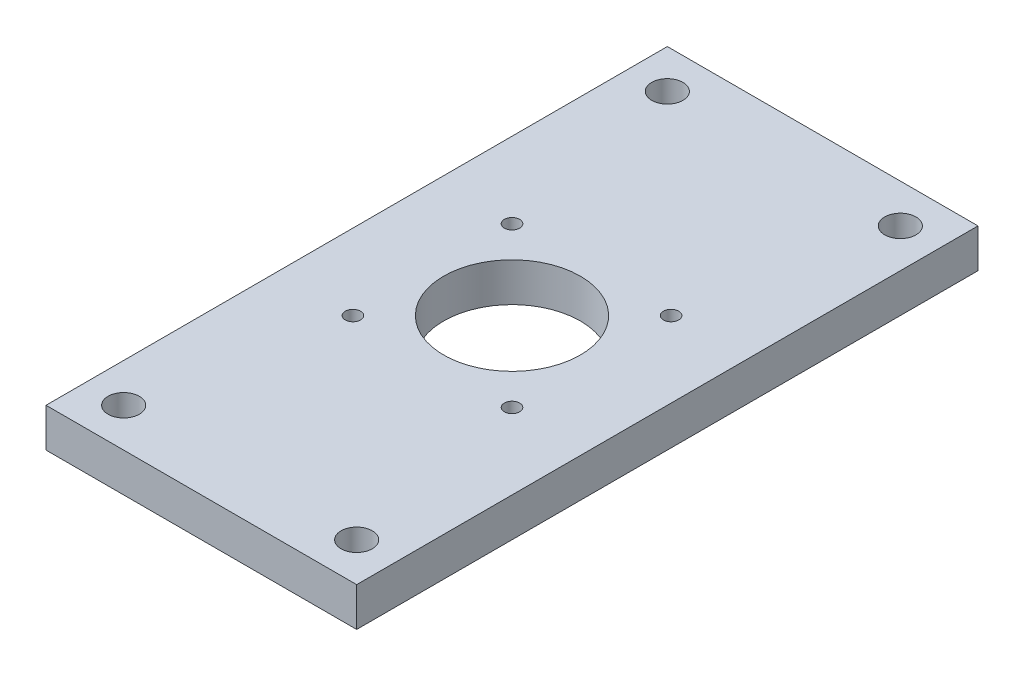
ISO-10303-21;
HEADER;
FILE_DESCRIPTION(('STEP AP214'),'2;1');
FILE_NAME('part.step','',(''),(''),'','','');
FILE_SCHEMA(('AUTOMOTIVE_DESIGN { 1 0 10303 214 1 1 1 1 }'));
ENDSEC;
DATA;
#1=APPLICATION_CONTEXT('core data for automotive mechanical design processes');
#2=APPLICATION_PROTOCOL_DEFINITION('international standard','automotive_design',2000,#1);
#3=PRODUCT_CONTEXT('',#1,'mechanical');
#4=PRODUCT('Part','Part','',(#3));
#5=PRODUCT_RELATED_PRODUCT_CATEGORY('part','',(#4));
#6=PRODUCT_DEFINITION_FORMATION('','',#4);
#7=PRODUCT_DEFINITION_CONTEXT('part definition',#1,'design');
#8=PRODUCT_DEFINITION('design','',#6,#7);
#9=PRODUCT_DEFINITION_SHAPE('','',#8);
#10=(LENGTH_UNIT() NAMED_UNIT(*) SI_UNIT(.MILLI.,.METRE.));
#11=(NAMED_UNIT(*) PLANE_ANGLE_UNIT() SI_UNIT($,.RADIAN.));
#12=(NAMED_UNIT(*) SI_UNIT($,.STERADIAN.) SOLID_ANGLE_UNIT());
#13=UNCERTAINTY_MEASURE_WITH_UNIT(LENGTH_MEASURE(1.E-05),#10,'distance_accuracy_value','');
#14=(GEOMETRIC_REPRESENTATION_CONTEXT(3) GLOBAL_UNCERTAINTY_ASSIGNED_CONTEXT((#13)) GLOBAL_UNIT_ASSIGNED_CONTEXT((#10,
#11,#12)) REPRESENTATION_CONTEXT('',''));
#15=CARTESIAN_POINT('',(0.,0.,0.));
#16=DIRECTION('',(0.,0.,1.));
#17=DIRECTION('',(1.,0.,0.));
#18=AXIS2_PLACEMENT_3D('',#15,#16,#17);
#19=CARTESIAN_POINT('',(-43.46194,-12.7,-50.8));
#20=DIRECTION('',(1.,0.,0.));
#21=DIRECTION('',(0.,0.,-1.));
#22=AXIS2_PLACEMENT_3D('',#19,#20,#21);
#23=PLANE('',#22);
#24=DIRECTION('',(0.,0.,-1.));
#25=VECTOR('',#24,1.);
#26=CARTESIAN_POINT('',(-43.46194,-19.05,-50.8));
#27=LINE('',#26,#25);
#28=CARTESIAN_POINT('',(-43.46194,-19.05,50.8));
#29=VERTEX_POINT('',#28);
#30=CARTESIAN_POINT('',(-43.46194,-19.05,-50.8));
#31=VERTEX_POINT('',#30);
#32=EDGE_CURVE('E99',#29,#31,#27,.T.);
#33=ORIENTED_EDGE('',*,*,#32,.T.);
#34=DIRECTION('',(0.,-1.,0.));
#35=VECTOR('',#34,1.);
#36=CARTESIAN_POINT('',(-43.46194,-12.7,-50.8));
#37=LINE('',#36,#35);
#38=CARTESIAN_POINT('',(-43.46194,-12.7,-50.8));
#39=VERTEX_POINT('',#38);
#40=EDGE_CURVE('E38',#39,#31,#37,.T.);
#41=ORIENTED_EDGE('',*,*,#40,.F.);
#42=DIRECTION('',(0.,0.,-1.));
#43=VECTOR('',#42,1.);
#44=CARTESIAN_POINT('',(-43.46194,-12.7,-50.8));
#45=LINE('',#44,#43);
#46=CARTESIAN_POINT('',(-43.46194,-12.7,50.8));
#47=VERTEX_POINT('',#46);
#48=EDGE_CURVE('E88',#47,#39,#45,.T.);
#49=ORIENTED_EDGE('',*,*,#48,.F.);
#50=DIRECTION('',(0.,-1.,0.));
#51=VECTOR('',#50,1.);
#52=CARTESIAN_POINT('',(-43.46194,-12.7,50.8));
#53=LINE('',#52,#51);
#54=EDGE_CURVE('E11',#47,#29,#53,.T.);
#55=ORIENTED_EDGE('',*,*,#54,.T.);
#56=EDGE_LOOP('',(#33,#41,#49,#55));
#57=FACE_BOUND('',#56,.T.);
#58=ADVANCED_FACE('F35',(#57),#23,.T.);
#59=CARTESIAN_POINT('',(-94.26194,-12.7,50.8));
#60=DIRECTION('',(0.,0.,1.));
#61=DIRECTION('',(1.,0.,0.));
#62=AXIS2_PLACEMENT_3D('',#59,#60,#61);
#63=PLANE('',#62);
#64=DIRECTION('',(1.,0.,0.));
#65=VECTOR('',#64,1.);
#66=CARTESIAN_POINT('',(-94.26194,-19.05,50.8));
#67=LINE('',#66,#65);
#68=CARTESIAN_POINT('',(-94.26194,-19.05,50.8));
#69=VERTEX_POINT('',#68);
#70=EDGE_CURVE('E76',#69,#29,#67,.T.);
#71=ORIENTED_EDGE('',*,*,#70,.T.);
#72=ORIENTED_EDGE('',*,*,#54,.F.);
#73=DIRECTION('',(1.,0.,0.));
#74=VECTOR('',#73,1.);
#75=CARTESIAN_POINT('',(-94.26194,-12.7,50.8));
#76=LINE('',#75,#74);
#77=CARTESIAN_POINT('',(-94.26194,-12.7,50.8));
#78=VERTEX_POINT('',#77);
#79=EDGE_CURVE('E53',#78,#47,#76,.T.);
#80=ORIENTED_EDGE('',*,*,#79,.F.);
#81=DIRECTION('',(0.,-1.,0.));
#82=VECTOR('',#81,1.);
#83=CARTESIAN_POINT('',(-94.26194,-12.7,50.8));
#84=LINE('',#83,#82);
#85=EDGE_CURVE('E44',#78,#69,#84,.T.);
#86=ORIENTED_EDGE('',*,*,#85,.T.);
#87=EDGE_LOOP('',(#71,#72,#80,#86));
#88=FACE_BOUND('',#87,.T.);
#89=ADVANCED_FACE('F106',(#88),#63,.T.);
#90=CARTESIAN_POINT('',(-94.26194,-12.7,-50.8));
#91=DIRECTION('',(-1.,0.,0.));
#92=DIRECTION('',(0.,0.,1.));
#93=AXIS2_PLACEMENT_3D('',#90,#91,#92);
#94=PLANE('',#93);
#95=DIRECTION('',(0.,0.,1.));
#96=VECTOR('',#95,1.);
#97=CARTESIAN_POINT('',(-94.26194,-19.05,-50.8));
#98=LINE('',#97,#96);
#99=CARTESIAN_POINT('',(-94.26194,-19.05,-50.8));
#100=VERTEX_POINT('',#99);
#101=EDGE_CURVE('E70',#100,#69,#98,.T.);
#102=ORIENTED_EDGE('',*,*,#101,.T.);
#103=ORIENTED_EDGE('',*,*,#85,.F.);
#104=DIRECTION('',(0.,0.,1.));
#105=VECTOR('',#104,1.);
#106=CARTESIAN_POINT('',(-94.26194,-12.7,-50.8));
#107=LINE('',#106,#105);
#108=CARTESIAN_POINT('',(-94.26194,-12.7,-50.8));
#109=VERTEX_POINT('',#108);
#110=EDGE_CURVE('E86',#109,#78,#107,.T.);
#111=ORIENTED_EDGE('',*,*,#110,.F.);
#112=DIRECTION('',(0.,-1.,0.));
#113=VECTOR('',#112,1.);
#114=CARTESIAN_POINT('',(-94.26194,-12.7,-50.8));
#115=LINE('',#114,#113);
#116=EDGE_CURVE('E91',#109,#100,#115,.T.);
#117=ORIENTED_EDGE('',*,*,#116,.T.);
#118=EDGE_LOOP('',(#102,#103,#111,#117));
#119=FACE_BOUND('',#118,.T.);
#120=ADVANCED_FACE('F94',(#119),#94,.T.);
#121=CARTESIAN_POINT('',(-94.26194,-12.7,-50.8));
#122=DIRECTION('',(0.,0.,-1.));
#123=DIRECTION('',(-1.,0.,0.));
#124=AXIS2_PLACEMENT_3D('',#121,#122,#123);
#125=PLANE('',#124);
#126=DIRECTION('',(-1.,0.,0.));
#127=VECTOR('',#126,1.);
#128=CARTESIAN_POINT('',(-94.26194,-19.05,-50.8));
#129=LINE('',#128,#127);
#130=EDGE_CURVE('E93',#31,#100,#129,.T.);
#131=ORIENTED_EDGE('',*,*,#130,.T.);
#132=ORIENTED_EDGE('',*,*,#116,.F.);
#133=DIRECTION('',(-1.,0.,0.));
#134=VECTOR('',#133,1.);
#135=CARTESIAN_POINT('',(-94.26194,-12.7,-50.8));
#136=LINE('',#135,#134);
#137=EDGE_CURVE('E83',#39,#109,#136,.T.);
#138=ORIENTED_EDGE('',*,*,#137,.F.);
#139=ORIENTED_EDGE('',*,*,#40,.T.);
#140=EDGE_LOOP('',(#131,#132,#138,#139));
#141=FACE_BOUND('',#140,.T.);
#142=ADVANCED_FACE('F92',(#141),#125,.T.);
#143=CARTESIAN_POINT('',(0.,-12.7,0.));
#144=DIRECTION('',(0.,-1.,0.));
#145=DIRECTION('',(0.,0.,1.));
#146=AXIS2_PLACEMENT_3D('',#143,#144,#145);
#147=PLANE('',#146);
#148=CARTESIAN_POINT('',(-49.81194,-12.7,44.45));
#149=DIRECTION('',(0.,-1.,0.));
#150=DIRECTION('',(0.,0.,-1.));
#151=AXIS2_PLACEMENT_3D('',#148,#149,#150);
#152=CIRCLE('',#151,2.5527);
#153=CARTESIAN_POINT('',(-49.81194,-12.7,47.0027));
#154=VERTEX_POINT('',#153);
#155=EDGE_CURVE('E131',#154,#154,#152,.T.);
#156=ORIENTED_EDGE('',*,*,#155,.T.);
#157=EDGE_LOOP('',(#156));
#158=FACE_BOUND('',#157,.T.);
#159=CARTESIAN_POINT('',(-49.81194,-12.7,-44.45));
#160=DIRECTION('',(0.,-1.,0.));
#161=DIRECTION('',(0.,0.,-1.));
#162=AXIS2_PLACEMENT_3D('',#159,#160,#161);
#163=CIRCLE('',#162,2.5527);
#164=CARTESIAN_POINT('',(-49.81194,-12.7,-41.8973));
#165=VERTEX_POINT('',#164);
#166=EDGE_CURVE('E144',#165,#165,#163,.T.);
#167=ORIENTED_EDGE('',*,*,#166,.T.);
#168=EDGE_LOOP('',(#167));
#169=FACE_BOUND('',#168,.T.);
#170=CARTESIAN_POINT('',(-87.91194,-12.7,44.45));
#171=DIRECTION('',(0.,-1.,0.));
#172=DIRECTION('',(0.,0.,-1.));
#173=AXIS2_PLACEMENT_3D('',#170,#171,#172);
#174=CIRCLE('',#173,2.5527);
#175=CARTESIAN_POINT('',(-87.91194,-12.7,47.0027));
#176=VERTEX_POINT('',#175);
#177=EDGE_CURVE('E147',#176,#176,#174,.T.);
#178=ORIENTED_EDGE('',*,*,#177,.T.);
#179=EDGE_LOOP('',(#178));
#180=FACE_BOUND('',#179,.T.);
#181=CARTESIAN_POINT('',(-87.91194,-12.7,-44.45));
#182=DIRECTION('',(0.,-1.,0.));
#183=DIRECTION('',(0.,0.,-1.));
#184=AXIS2_PLACEMENT_3D('',#181,#182,#183);
#185=CIRCLE('',#184,2.55270000000001);
#186=CARTESIAN_POINT('',(-87.91194,-12.7,-41.8973));
#187=VERTEX_POINT('',#186);
#188=EDGE_CURVE('E150',#187,#187,#185,.T.);
#189=ORIENTED_EDGE('',*,*,#188,.T.);
#190=EDGE_LOOP('',(#189));
#191=FACE_BOUND('',#190,.T.);
#192=CARTESIAN_POINT('',(-81.86674,-12.7,-13.0048));
#193=DIRECTION('',(0.,-1.,0.));
#194=DIRECTION('',(0.,0.,-1.));
#195=AXIS2_PLACEMENT_3D('',#192,#193,#194);
#196=CIRCLE('',#195,1.25);
#197=CARTESIAN_POINT('',(-81.86674,-12.7,-14.2548));
#198=VERTEX_POINT('',#197);
#199=EDGE_CURVE('E124',#198,#198,#196,.F.);
#200=ORIENTED_EDGE('',*,*,#199,.F.);
#201=EDGE_LOOP('',(#200));
#202=FACE_BOUND('',#201,.T.);
#203=CARTESIAN_POINT('',(-55.85714,-12.7,-13.0048));
#204=DIRECTION('',(0.,-1.,0.));
#205=DIRECTION('',(0.,0.,-1.));
#206=AXIS2_PLACEMENT_3D('',#203,#204,#205);
#207=CIRCLE('',#206,1.25);
#208=CARTESIAN_POINT('',(-55.85714,-12.7,-14.2548));
#209=VERTEX_POINT('',#208);
#210=EDGE_CURVE('E132',#209,#209,#207,.F.);
#211=ORIENTED_EDGE('',*,*,#210,.F.);
#212=EDGE_LOOP('',(#211));
#213=FACE_BOUND('',#212,.T.);
#214=CARTESIAN_POINT('',(-55.85714,-12.7,13.0048));
#215=DIRECTION('',(0.,-1.,0.));
#216=DIRECTION('',(0.,0.,-1.));
#217=AXIS2_PLACEMENT_3D('',#214,#215,#216);
#218=CIRCLE('',#217,1.25);
#219=CARTESIAN_POINT('',(-55.85714,-12.7,11.7548));
#220=VERTEX_POINT('',#219);
#221=EDGE_CURVE('E123',#220,#220,#218,.F.);
#222=ORIENTED_EDGE('',*,*,#221,.F.);
#223=EDGE_LOOP('',(#222));
#224=FACE_BOUND('',#223,.T.);
#225=CARTESIAN_POINT('',(-81.86674,-12.7,13.0048));
#226=DIRECTION('',(0.,-1.,0.));
#227=DIRECTION('',(0.,0.,-1.));
#228=AXIS2_PLACEMENT_3D('',#225,#226,#227);
#229=CIRCLE('',#228,1.25);
#230=CARTESIAN_POINT('',(-81.86674,-12.7,11.7548));
#231=VERTEX_POINT('',#230);
#232=EDGE_CURVE('E117',#231,#231,#229,.F.);
#233=ORIENTED_EDGE('',*,*,#232,.F.);
#234=EDGE_LOOP('',(#233));
#235=FACE_BOUND('',#234,.T.);
#236=CARTESIAN_POINT('',(-68.86194,-12.7,0.));
#237=DIRECTION('',(0.,-1.,0.));
#238=DIRECTION('',(0.,0.,-1.));
#239=AXIS2_PLACEMENT_3D('',#236,#237,#238);
#240=CIRCLE('',#239,11.176);
#241=CARTESIAN_POINT('',(-68.86194,-12.7,-11.176));
#242=VERTEX_POINT('',#241);
#243=EDGE_CURVE('E102',#242,#242,#240,.F.);
#244=ORIENTED_EDGE('',*,*,#243,.F.);
#245=EDGE_LOOP('',(#244));
#246=FACE_BOUND('',#245,.T.);
#247=ORIENTED_EDGE('',*,*,#48,.T.);
#248=ORIENTED_EDGE('',*,*,#137,.T.);
#249=ORIENTED_EDGE('',*,*,#110,.T.);
#250=ORIENTED_EDGE('',*,*,#79,.T.);
#251=EDGE_LOOP('',(#247,#248,#249,#250));
#252=FACE_BOUND('',#251,.T.);
#253=ADVANCED_FACE('F84',(#158,#169,#180,#191,#202,#213,#224,#235,#246,#252),#147,.F.);
#254=CARTESIAN_POINT('',(0.,-19.05,0.));
#255=DIRECTION('',(0.,-1.,0.));
#256=DIRECTION('',(0.,0.,1.));
#257=AXIS2_PLACEMENT_3D('',#254,#255,#256);
#258=PLANE('',#257);
#259=CARTESIAN_POINT('',(-49.81194,-19.05,44.45));
#260=DIRECTION('',(0.,1.,0.));
#261=DIRECTION('',(0.,0.,1.));
#262=AXIS2_PLACEMENT_3D('',#259,#260,#261);
#263=CIRCLE('',#262,2.5527);
#264=CARTESIAN_POINT('',(-49.81194,-19.05,47.0027));
#265=VERTEX_POINT('',#264);
#266=EDGE_CURVE('E153',#265,#265,#263,.T.);
#267=ORIENTED_EDGE('',*,*,#266,.T.);
#268=EDGE_LOOP('',(#267));
#269=FACE_BOUND('',#268,.T.);
#270=CARTESIAN_POINT('',(-49.81194,-19.05,-44.45));
#271=DIRECTION('',(0.,1.,0.));
#272=DIRECTION('',(0.,0.,-1.));
#273=AXIS2_PLACEMENT_3D('',#270,#271,#272);
#274=CIRCLE('',#273,2.5527);
#275=CARTESIAN_POINT('',(-49.81194,-19.05,-41.8973));
#276=VERTEX_POINT('',#275);
#277=EDGE_CURVE('E160',#276,#276,#274,.T.);
#278=ORIENTED_EDGE('',*,*,#277,.T.);
#279=EDGE_LOOP('',(#278));
#280=FACE_BOUND('',#279,.T.);
#281=CARTESIAN_POINT('',(-87.91194,-19.05,44.45));
#282=DIRECTION('',(0.,1.,0.));
#283=DIRECTION('',(0.,0.,-1.));
#284=AXIS2_PLACEMENT_3D('',#281,#282,#283);
#285=CIRCLE('',#284,2.5527);
#286=CARTESIAN_POINT('',(-87.91194,-19.05,47.0027));
#287=VERTEX_POINT('',#286);
#288=EDGE_CURVE('E157',#287,#287,#285,.T.);
#289=ORIENTED_EDGE('',*,*,#288,.T.);
#290=EDGE_LOOP('',(#289));
#291=FACE_BOUND('',#290,.T.);
#292=CARTESIAN_POINT('',(-87.91194,-19.05,-44.45));
#293=DIRECTION('',(0.,1.,0.));
#294=DIRECTION('',(0.,0.,1.));
#295=AXIS2_PLACEMENT_3D('',#292,#293,#294);
#296=CIRCLE('',#295,2.55270000000001);
#297=CARTESIAN_POINT('',(-87.91194,-19.05,-41.8973));
#298=VERTEX_POINT('',#297);
#299=EDGE_CURVE('E154',#298,#298,#296,.T.);
#300=ORIENTED_EDGE('',*,*,#299,.T.);
#301=EDGE_LOOP('',(#300));
#302=FACE_BOUND('',#301,.T.);
#303=CARTESIAN_POINT('',(-81.86674,-19.05,-13.0048));
#304=DIRECTION('',(0.,-1.,0.));
#305=DIRECTION('',(0.,0.,-1.));
#306=AXIS2_PLACEMENT_3D('',#303,#304,#305);
#307=CIRCLE('',#306,1.25);
#308=CARTESIAN_POINT('',(-81.86674,-19.05,-14.2548));
#309=VERTEX_POINT('',#308);
#310=EDGE_CURVE('E128',#309,#309,#307,.T.);
#311=ORIENTED_EDGE('',*,*,#310,.F.);
#312=EDGE_LOOP('',(#311));
#313=FACE_BOUND('',#312,.T.);
#314=CARTESIAN_POINT('',(-55.85714,-19.05,-13.0048));
#315=DIRECTION('',(0.,-1.,0.));
#316=DIRECTION('',(0.,0.,-1.));
#317=AXIS2_PLACEMENT_3D('',#314,#315,#316);
#318=CIRCLE('',#317,1.25);
#319=CARTESIAN_POINT('',(-55.85714,-19.05,-14.2548));
#320=VERTEX_POINT('',#319);
#321=EDGE_CURVE('E127',#320,#320,#318,.T.);
#322=ORIENTED_EDGE('',*,*,#321,.F.);
#323=EDGE_LOOP('',(#322));
#324=FACE_BOUND('',#323,.T.);
#325=CARTESIAN_POINT('',(-55.85714,-19.05,13.0048));
#326=DIRECTION('',(0.,-1.,0.));
#327=DIRECTION('',(0.,0.,-1.));
#328=AXIS2_PLACEMENT_3D('',#325,#326,#327);
#329=CIRCLE('',#328,1.25);
#330=CARTESIAN_POINT('',(-55.85714,-19.05,11.7548));
#331=VERTEX_POINT('',#330);
#332=EDGE_CURVE('E135',#331,#331,#329,.T.);
#333=ORIENTED_EDGE('',*,*,#332,.F.);
#334=EDGE_LOOP('',(#333));
#335=FACE_BOUND('',#334,.T.);
#336=CARTESIAN_POINT('',(-81.86674,-19.05,13.0048));
#337=DIRECTION('',(0.,-1.,0.));
#338=DIRECTION('',(0.,0.,-1.));
#339=AXIS2_PLACEMENT_3D('',#336,#337,#338);
#340=CIRCLE('',#339,1.25);
#341=CARTESIAN_POINT('',(-81.86674,-19.05,11.7548));
#342=VERTEX_POINT('',#341);
#343=EDGE_CURVE('E120',#342,#342,#340,.T.);
#344=ORIENTED_EDGE('',*,*,#343,.F.);
#345=EDGE_LOOP('',(#344));
#346=FACE_BOUND('',#345,.T.);
#347=CARTESIAN_POINT('',(-68.86194,-19.05,0.));
#348=DIRECTION('',(0.,-1.,0.));
#349=DIRECTION('',(0.,0.,-1.));
#350=AXIS2_PLACEMENT_3D('',#347,#348,#349);
#351=CIRCLE('',#350,11.176);
#352=CARTESIAN_POINT('',(-68.86194,-19.05,-11.176));
#353=VERTEX_POINT('',#352);
#354=EDGE_CURVE('E114',#353,#353,#351,.T.);
#355=ORIENTED_EDGE('',*,*,#354,.F.);
#356=EDGE_LOOP('',(#355));
#357=FACE_BOUND('',#356,.T.);
#358=ORIENTED_EDGE('',*,*,#32,.F.);
#359=ORIENTED_EDGE('',*,*,#70,.F.);
#360=ORIENTED_EDGE('',*,*,#101,.F.);
#361=ORIENTED_EDGE('',*,*,#130,.F.);
#362=EDGE_LOOP('',(#358,#359,#360,#361));
#363=FACE_BOUND('',#362,.T.);
#364=ADVANCED_FACE('F109',(#269,#280,#291,#302,#313,#324,#335,#346,#357,#363),#258,.T.);
#365=CARTESIAN_POINT('',(-68.86194,19.051,0.));
#366=DIRECTION('',(0.,-1.,0.));
#367=DIRECTION('',(0.,0.,-1.));
#368=AXIS2_PLACEMENT_3D('',#365,#366,#367);
#369=CYLINDRICAL_SURFACE('',#368,11.176);
#370=ORIENTED_EDGE('',*,*,#354,.T.);
#371=EDGE_LOOP('',(#370));
#372=FACE_BOUND('',#371,.T.);
#373=ORIENTED_EDGE('',*,*,#243,.T.);
#374=EDGE_LOOP('',(#373));
#375=FACE_BOUND('',#374,.T.);
#376=ADVANCED_FACE('F194',(#372,#375),#369,.F.);
#377=CARTESIAN_POINT('',(-81.86674,19.051,13.0048));
#378=DIRECTION('',(0.,-1.,0.));
#379=DIRECTION('',(0.,0.,-1.));
#380=AXIS2_PLACEMENT_3D('',#377,#378,#379);
#381=CYLINDRICAL_SURFACE('',#380,1.25);
#382=ORIENTED_EDGE('',*,*,#343,.T.);
#383=EDGE_LOOP('',(#382));
#384=FACE_BOUND('',#383,.T.);
#385=ORIENTED_EDGE('',*,*,#232,.T.);
#386=EDGE_LOOP('',(#385));
#387=FACE_BOUND('',#386,.T.);
#388=ADVANCED_FACE('F196',(#384,#387),#381,.F.);
#389=CARTESIAN_POINT('',(-55.85714,19.051,13.0048));
#390=DIRECTION('',(0.,-1.,0.));
#391=DIRECTION('',(0.,0.,-1.));
#392=AXIS2_PLACEMENT_3D('',#389,#390,#391);
#393=CYLINDRICAL_SURFACE('',#392,1.25);
#394=ORIENTED_EDGE('',*,*,#332,.T.);
#395=EDGE_LOOP('',(#394));
#396=FACE_BOUND('',#395,.T.);
#397=ORIENTED_EDGE('',*,*,#221,.T.);
#398=EDGE_LOOP('',(#397));
#399=FACE_BOUND('',#398,.T.);
#400=ADVANCED_FACE('F203',(#396,#399),#393,.F.);
#401=CARTESIAN_POINT('',(-55.85714,19.051,-13.0048));
#402=DIRECTION('',(0.,-1.,0.));
#403=DIRECTION('',(0.,0.,-1.));
#404=AXIS2_PLACEMENT_3D('',#401,#402,#403);
#405=CYLINDRICAL_SURFACE('',#404,1.25);
#406=ORIENTED_EDGE('',*,*,#321,.T.);
#407=EDGE_LOOP('',(#406));
#408=FACE_BOUND('',#407,.T.);
#409=ORIENTED_EDGE('',*,*,#210,.T.);
#410=EDGE_LOOP('',(#409));
#411=FACE_BOUND('',#410,.T.);
#412=ADVANCED_FACE('F252',(#408,#411),#405,.F.);
#413=CARTESIAN_POINT('',(-81.86674,19.051,-13.0048));
#414=DIRECTION('',(0.,-1.,0.));
#415=DIRECTION('',(0.,0.,-1.));
#416=AXIS2_PLACEMENT_3D('',#413,#414,#415);
#417=CYLINDRICAL_SURFACE('',#416,1.25);
#418=ORIENTED_EDGE('',*,*,#310,.T.);
#419=EDGE_LOOP('',(#418));
#420=FACE_BOUND('',#419,.T.);
#421=ORIENTED_EDGE('',*,*,#199,.T.);
#422=EDGE_LOOP('',(#421));
#423=FACE_BOUND('',#422,.T.);
#424=ADVANCED_FACE('F263',(#420,#423),#417,.F.);
#425=CARTESIAN_POINT('',(-87.91194,-19.05,-44.45));
#426=DIRECTION('',(0.,1.,0.));
#427=DIRECTION('',(0.,0.,1.));
#428=AXIS2_PLACEMENT_3D('',#425,#426,#427);
#429=CYLINDRICAL_SURFACE('',#428,2.55270000000001);
#430=CARTESIAN_POINT('',(-87.91194,-19.05,-41.8973));
#431=CARTESIAN_POINT('',(-87.91194,-18.9838541666667,-41.8973));
#432=CARTESIAN_POINT('',(-87.91194,-18.9177083333333,-41.8973));
#433=CARTESIAN_POINT('',(-87.91194,-18.7854166666667,-41.8973));
#434=CARTESIAN_POINT('',(-87.91194,-18.7192708333333,-41.8973));
#435=CARTESIAN_POINT('',(-87.91194,-18.5869791666667,-41.8973));
#436=CARTESIAN_POINT('',(-87.91194,-18.5208333333333,-41.8973));
#437=CARTESIAN_POINT('',(-87.91194,-18.3885416666667,-41.8973));
#438=CARTESIAN_POINT('',(-87.91194,-18.3223958333333,-41.8973));
#439=CARTESIAN_POINT('',(-87.91194,-18.1901041666667,-41.8973));
#440=CARTESIAN_POINT('',(-87.91194,-18.1239583333333,-41.8973));
#441=CARTESIAN_POINT('',(-87.91194,-17.9916666666667,-41.8973));
#442=CARTESIAN_POINT('',(-87.91194,-17.9255208333333,-41.8973));
#443=CARTESIAN_POINT('',(-87.91194,-17.7932291666667,-41.8973));
#444=CARTESIAN_POINT('',(-87.91194,-17.7270833333333,-41.8973));
#445=CARTESIAN_POINT('',(-87.91194,-17.5947916666667,-41.8973));
#446=CARTESIAN_POINT('',(-87.91194,-17.5286458333333,-41.8973));
#447=CARTESIAN_POINT('',(-87.91194,-17.3963541666667,-41.8973));
#448=CARTESIAN_POINT('',(-87.91194,-17.3302083333333,-41.8973));
#449=CARTESIAN_POINT('',(-87.91194,-17.1979166666667,-41.8973));
#450=CARTESIAN_POINT('',(-87.91194,-17.1317708333333,-41.8973));
#451=CARTESIAN_POINT('',(-87.91194,-16.9994791666667,-41.8973));
#452=CARTESIAN_POINT('',(-87.91194,-16.9333333333333,-41.8973));
#453=CARTESIAN_POINT('',(-87.91194,-16.8010416666667,-41.8973));
#454=CARTESIAN_POINT('',(-87.91194,-16.7348958333333,-41.8973));
#455=CARTESIAN_POINT('',(-87.91194,-16.6026041666667,-41.8973));
#456=CARTESIAN_POINT('',(-87.91194,-16.5364583333333,-41.8973));
#457=CARTESIAN_POINT('',(-87.91194,-16.4041666666667,-41.8973));
#458=CARTESIAN_POINT('',(-87.91194,-16.3380208333333,-41.8973));
#459=CARTESIAN_POINT('',(-87.91194,-16.2057291666667,-41.8973));
#460=CARTESIAN_POINT('',(-87.91194,-16.1395833333333,-41.8973));
#461=CARTESIAN_POINT('',(-87.91194,-16.0072916666667,-41.8973));
#462=CARTESIAN_POINT('',(-87.91194,-15.9411458333333,-41.8973));
#463=CARTESIAN_POINT('',(-87.91194,-15.8088541666667,-41.8973));
#464=CARTESIAN_POINT('',(-87.91194,-15.7427083333333,-41.8973));
#465=CARTESIAN_POINT('',(-87.91194,-15.6104166666667,-41.8973));
#466=CARTESIAN_POINT('',(-87.91194,-15.5442708333333,-41.8973));
#467=CARTESIAN_POINT('',(-87.91194,-15.4119791666667,-41.8973));
#468=CARTESIAN_POINT('',(-87.91194,-15.3458333333333,-41.8973));
#469=CARTESIAN_POINT('',(-87.91194,-15.2135416666667,-41.8973));
#470=CARTESIAN_POINT('',(-87.91194,-15.1473958333333,-41.8973));
#471=CARTESIAN_POINT('',(-87.91194,-15.0151041666667,-41.8973));
#472=CARTESIAN_POINT('',(-87.91194,-14.9489583333333,-41.8973));
#473=CARTESIAN_POINT('',(-87.91194,-14.8166666666667,-41.8973));
#474=CARTESIAN_POINT('',(-87.91194,-14.7505208333333,-41.8973));
#475=CARTESIAN_POINT('',(-87.91194,-14.6182291666667,-41.8973));
#476=CARTESIAN_POINT('',(-87.91194,-14.5520833333333,-41.8973));
#477=CARTESIAN_POINT('',(-87.91194,-14.4197916666667,-41.8973));
#478=CARTESIAN_POINT('',(-87.91194,-14.3536458333333,-41.8973));
#479=CARTESIAN_POINT('',(-87.91194,-14.2213541666667,-41.8973));
#480=CARTESIAN_POINT('',(-87.91194,-14.1552083333333,-41.8973));
#481=CARTESIAN_POINT('',(-87.91194,-14.0229166666667,-41.8973));
#482=CARTESIAN_POINT('',(-87.91194,-13.9567708333333,-41.8973));
#483=CARTESIAN_POINT('',(-87.91194,-13.8244791666667,-41.8973));
#484=CARTESIAN_POINT('',(-87.91194,-13.7583333333333,-41.8973));
#485=CARTESIAN_POINT('',(-87.91194,-13.6260416666667,-41.8973));
#486=CARTESIAN_POINT('',(-87.91194,-13.5598958333333,-41.8973));
#487=CARTESIAN_POINT('',(-87.91194,-13.4276041666667,-41.8973));
#488=CARTESIAN_POINT('',(-87.91194,-13.3614583333333,-41.8973));
#489=CARTESIAN_POINT('',(-87.91194,-13.2291666666667,-41.8973));
#490=CARTESIAN_POINT('',(-87.91194,-13.1630208333333,-41.8973));
#491=CARTESIAN_POINT('',(-87.91194,-13.0307291666667,-41.8973));
#492=CARTESIAN_POINT('',(-87.91194,-12.9645833333333,-41.8973));
#493=CARTESIAN_POINT('',(-87.91194,-12.8322916666667,-41.8973));
#494=CARTESIAN_POINT('',(-87.91194,-12.7661458333333,-41.8973));
#495=CARTESIAN_POINT('',(-87.91194,-12.7,-41.8973));
#496=B_SPLINE_CURVE_WITH_KNOTS('',3,(#430,#431,#432,#433,#434,#435,#436,#437,#438,#439,#440,
#441,#442,#443,#444,#445,#446,#447,#448,#449,#450,#451,#452,#453,#454,#455,#456,#457,#458,#459,
#460,#461,#462,#463,#464,#465,#466,#467,#468,#469,#470,#471,#472,#473,#474,#475,#476,#477,#478,
#479,#480,#481,#482,#483,#484,#485,#486,#487,#488,#489,#490,#491,#492,#493,#494,#495),
.UNSPECIFIED.,.F.,.F.,(4,2,2,2,2,2,2,2,2,2,2,2,2,2,2,2,2,2,2,2,2,2,2,2,2,2,2,2,2,2,2,2,4),(0.,
0.198437500000002,0.396875000000001,0.5953125,0.793750000000003,0.992187500000002,1.190625,
1.3890625,1.5875,1.7859375,1.984375,2.1828125,2.38125,2.5796875,2.778125,2.9765625,3.175,
3.3734375,3.571875,3.7703125,3.96875,4.1671875,4.365625,4.5640625,4.7625,4.9609375,5.159375,
5.3578125,5.55625,5.7546875,5.953125,6.1515625,6.35),.UNSPECIFIED.);
#497=EDGE_CURVE('BSEAM273',#298,#187,#496,.T.);
#498=ORIENTED_EDGE('',*,*,#299,.F.);
#499=ORIENTED_EDGE('',*,*,#188,.F.);
#500=ORIENTED_EDGE('',*,*,#497,.T.);
#501=ORIENTED_EDGE('',*,*,#497,.F.);
#502=EDGE_LOOP('',(#498,#500,#499,#501));
#503=FACE_BOUND('',#502,.T.);
#504=ADVANCED_FACE('F273',(#503),#429,.F.);
#505=CARTESIAN_POINT('',(-87.91194,-19.05,44.45));
#506=DIRECTION('',(0.,1.,0.));
#507=DIRECTION('',(0.,0.,1.));
#508=AXIS2_PLACEMENT_3D('',#505,#506,#507);
#509=CYLINDRICAL_SURFACE('',#508,2.5527);
#510=CARTESIAN_POINT('',(-87.91194,-19.05,47.0027));
#511=CARTESIAN_POINT('',(-87.91194,-18.9838541666667,47.0027));
#512=CARTESIAN_POINT('',(-87.91194,-18.9177083333333,47.0027));
#513=CARTESIAN_POINT('',(-87.91194,-18.7854166666667,47.0027));
#514=CARTESIAN_POINT('',(-87.91194,-18.7192708333333,47.0027));
#515=CARTESIAN_POINT('',(-87.91194,-18.5869791666667,47.0027));
#516=CARTESIAN_POINT('',(-87.91194,-18.5208333333333,47.0027));
#517=CARTESIAN_POINT('',(-87.91194,-18.3885416666667,47.0027));
#518=CARTESIAN_POINT('',(-87.91194,-18.3223958333333,47.0027));
#519=CARTESIAN_POINT('',(-87.91194,-18.1901041666667,47.0027));
#520=CARTESIAN_POINT('',(-87.91194,-18.1239583333333,47.0027));
#521=CARTESIAN_POINT('',(-87.91194,-17.9916666666667,47.0027));
#522=CARTESIAN_POINT('',(-87.91194,-17.9255208333333,47.0027));
#523=CARTESIAN_POINT('',(-87.91194,-17.7932291666667,47.0027));
#524=CARTESIAN_POINT('',(-87.91194,-17.7270833333333,47.0027));
#525=CARTESIAN_POINT('',(-87.91194,-17.5947916666667,47.0027));
#526=CARTESIAN_POINT('',(-87.91194,-17.5286458333333,47.0027));
#527=CARTESIAN_POINT('',(-87.91194,-17.3963541666667,47.0027));
#528=CARTESIAN_POINT('',(-87.91194,-17.3302083333333,47.0027));
#529=CARTESIAN_POINT('',(-87.91194,-17.1979166666667,47.0027));
#530=CARTESIAN_POINT('',(-87.91194,-17.1317708333333,47.0027));
#531=CARTESIAN_POINT('',(-87.91194,-16.9994791666667,47.0027));
#532=CARTESIAN_POINT('',(-87.91194,-16.9333333333333,47.0027));
#533=CARTESIAN_POINT('',(-87.91194,-16.8010416666667,47.0027));
#534=CARTESIAN_POINT('',(-87.91194,-16.7348958333333,47.0027));
#535=CARTESIAN_POINT('',(-87.91194,-16.6026041666667,47.0027));
#536=CARTESIAN_POINT('',(-87.91194,-16.5364583333333,47.0027));
#537=CARTESIAN_POINT('',(-87.91194,-16.4041666666667,47.0027));
#538=CARTESIAN_POINT('',(-87.91194,-16.3380208333333,47.0027));
#539=CARTESIAN_POINT('',(-87.91194,-16.2057291666667,47.0027));
#540=CARTESIAN_POINT('',(-87.91194,-16.1395833333333,47.0027));
#541=CARTESIAN_POINT('',(-87.91194,-16.0072916666667,47.0027));
#542=CARTESIAN_POINT('',(-87.91194,-15.9411458333333,47.0027));
#543=CARTESIAN_POINT('',(-87.91194,-15.8088541666667,47.0027));
#544=CARTESIAN_POINT('',(-87.91194,-15.7427083333333,47.0027));
#545=CARTESIAN_POINT('',(-87.91194,-15.6104166666667,47.0027));
#546=CARTESIAN_POINT('',(-87.91194,-15.5442708333333,47.0027));
#547=CARTESIAN_POINT('',(-87.91194,-15.4119791666667,47.0027));
#548=CARTESIAN_POINT('',(-87.91194,-15.3458333333333,47.0027));
#549=CARTESIAN_POINT('',(-87.91194,-15.2135416666667,47.0027));
#550=CARTESIAN_POINT('',(-87.91194,-15.1473958333333,47.0027));
#551=CARTESIAN_POINT('',(-87.91194,-15.0151041666667,47.0027));
#552=CARTESIAN_POINT('',(-87.91194,-14.9489583333333,47.0027));
#553=CARTESIAN_POINT('',(-87.91194,-14.8166666666667,47.0027));
#554=CARTESIAN_POINT('',(-87.91194,-14.7505208333333,47.0027));
#555=CARTESIAN_POINT('',(-87.91194,-14.6182291666667,47.0027));
#556=CARTESIAN_POINT('',(-87.91194,-14.5520833333333,47.0027));
#557=CARTESIAN_POINT('',(-87.91194,-14.4197916666667,47.0027));
#558=CARTESIAN_POINT('',(-87.91194,-14.3536458333333,47.0027));
#559=CARTESIAN_POINT('',(-87.91194,-14.2213541666667,47.0027));
#560=CARTESIAN_POINT('',(-87.91194,-14.1552083333333,47.0027));
#561=CARTESIAN_POINT('',(-87.91194,-14.0229166666667,47.0027));
#562=CARTESIAN_POINT('',(-87.91194,-13.9567708333333,47.0027));
#563=CARTESIAN_POINT('',(-87.91194,-13.8244791666667,47.0027));
#564=CARTESIAN_POINT('',(-87.91194,-13.7583333333333,47.0027));
#565=CARTESIAN_POINT('',(-87.91194,-13.6260416666667,47.0027));
#566=CARTESIAN_POINT('',(-87.91194,-13.5598958333333,47.0027));
#567=CARTESIAN_POINT('',(-87.91194,-13.4276041666667,47.0027));
#568=CARTESIAN_POINT('',(-87.91194,-13.3614583333333,47.0027));
#569=CARTESIAN_POINT('',(-87.91194,-13.2291666666667,47.0027));
#570=CARTESIAN_POINT('',(-87.91194,-13.1630208333333,47.0027));
#571=CARTESIAN_POINT('',(-87.91194,-13.0307291666667,47.0027));
#572=CARTESIAN_POINT('',(-87.91194,-12.9645833333333,47.0027));
#573=CARTESIAN_POINT('',(-87.91194,-12.8322916666667,47.0027));
#574=CARTESIAN_POINT('',(-87.91194,-12.7661458333333,47.0027));
#575=CARTESIAN_POINT('',(-87.91194,-12.7,47.0027));
#576=B_SPLINE_CURVE_WITH_KNOTS('',3,(#510,#511,#512,#513,#514,#515,#516,#517,#518,#519,#520,
#521,#522,#523,#524,#525,#526,#527,#528,#529,#530,#531,#532,#533,#534,#535,#536,#537,#538,#539,
#540,#541,#542,#543,#544,#545,#546,#547,#548,#549,#550,#551,#552,#553,#554,#555,#556,#557,#558,
#559,#560,#561,#562,#563,#564,#565,#566,#567,#568,#569,#570,#571,#572,#573,#574,#575),
.UNSPECIFIED.,.F.,.F.,(4,2,2,2,2,2,2,2,2,2,2,2,2,2,2,2,2,2,2,2,2,2,2,2,2,2,2,2,2,2,2,2,4),(0.,
0.198437500000002,0.396875000000001,0.5953125,0.793750000000003,0.992187500000002,1.190625,
1.3890625,1.5875,1.7859375,1.984375,2.1828125,2.38125,2.5796875,2.778125,2.9765625,3.175,
3.3734375,3.571875,3.7703125,3.96875,4.1671875,4.365625,4.5640625,4.7625,4.9609375,5.159375,
5.3578125,5.55625,5.7546875,5.953125,6.1515625,6.35),.UNSPECIFIED.);
#577=EDGE_CURVE('BSEAM283',#287,#176,#576,.T.);
#578=ORIENTED_EDGE('',*,*,#288,.F.);
#579=ORIENTED_EDGE('',*,*,#177,.F.);
#580=ORIENTED_EDGE('',*,*,#577,.T.);
#581=ORIENTED_EDGE('',*,*,#577,.F.);
#582=EDGE_LOOP('',(#578,#580,#579,#581));
#583=FACE_BOUND('',#582,.T.);
#584=ADVANCED_FACE('F283',(#583),#509,.F.);
#585=CARTESIAN_POINT('',(-49.81194,-19.05,-44.45));
#586=DIRECTION('',(0.,1.,0.));
#587=DIRECTION('',(0.,0.,1.));
#588=AXIS2_PLACEMENT_3D('',#585,#586,#587);
#589=CYLINDRICAL_SURFACE('',#588,2.5527);
#590=CARTESIAN_POINT('',(-49.81194,-19.05,-41.8973));
#591=CARTESIAN_POINT('',(-49.81194,-18.9838541666667,-41.8973));
#592=CARTESIAN_POINT('',(-49.81194,-18.9177083333333,-41.8973));
#593=CARTESIAN_POINT('',(-49.81194,-18.7854166666667,-41.8973));
#594=CARTESIAN_POINT('',(-49.81194,-18.7192708333333,-41.8973));
#595=CARTESIAN_POINT('',(-49.81194,-18.5869791666667,-41.8973));
#596=CARTESIAN_POINT('',(-49.81194,-18.5208333333333,-41.8973));
#597=CARTESIAN_POINT('',(-49.81194,-18.3885416666667,-41.8973));
#598=CARTESIAN_POINT('',(-49.81194,-18.3223958333333,-41.8973));
#599=CARTESIAN_POINT('',(-49.81194,-18.1901041666667,-41.8973));
#600=CARTESIAN_POINT('',(-49.81194,-18.1239583333333,-41.8973));
#601=CARTESIAN_POINT('',(-49.81194,-17.9916666666667,-41.8973));
#602=CARTESIAN_POINT('',(-49.81194,-17.9255208333333,-41.8973));
#603=CARTESIAN_POINT('',(-49.81194,-17.7932291666667,-41.8973));
#604=CARTESIAN_POINT('',(-49.81194,-17.7270833333333,-41.8973));
#605=CARTESIAN_POINT('',(-49.81194,-17.5947916666667,-41.8973));
#606=CARTESIAN_POINT('',(-49.81194,-17.5286458333333,-41.8973));
#607=CARTESIAN_POINT('',(-49.81194,-17.3963541666667,-41.8973));
#608=CARTESIAN_POINT('',(-49.81194,-17.3302083333333,-41.8973));
#609=CARTESIAN_POINT('',(-49.81194,-17.1979166666667,-41.8973));
#610=CARTESIAN_POINT('',(-49.81194,-17.1317708333333,-41.8973));
#611=CARTESIAN_POINT('',(-49.81194,-16.9994791666667,-41.8973));
#612=CARTESIAN_POINT('',(-49.81194,-16.9333333333333,-41.8973));
#613=CARTESIAN_POINT('',(-49.81194,-16.8010416666667,-41.8973));
#614=CARTESIAN_POINT('',(-49.81194,-16.7348958333333,-41.8973));
#615=CARTESIAN_POINT('',(-49.81194,-16.6026041666667,-41.8973));
#616=CARTESIAN_POINT('',(-49.81194,-16.5364583333333,-41.8973));
#617=CARTESIAN_POINT('',(-49.81194,-16.4041666666667,-41.8973));
#618=CARTESIAN_POINT('',(-49.81194,-16.3380208333333,-41.8973));
#619=CARTESIAN_POINT('',(-49.81194,-16.2057291666667,-41.8973));
#620=CARTESIAN_POINT('',(-49.81194,-16.1395833333333,-41.8973));
#621=CARTESIAN_POINT('',(-49.81194,-16.0072916666667,-41.8973));
#622=CARTESIAN_POINT('',(-49.81194,-15.9411458333333,-41.8973));
#623=CARTESIAN_POINT('',(-49.81194,-15.8088541666667,-41.8973));
#624=CARTESIAN_POINT('',(-49.81194,-15.7427083333333,-41.8973));
#625=CARTESIAN_POINT('',(-49.81194,-15.6104166666667,-41.8973));
#626=CARTESIAN_POINT('',(-49.81194,-15.5442708333333,-41.8973));
#627=CARTESIAN_POINT('',(-49.81194,-15.4119791666667,-41.8973));
#628=CARTESIAN_POINT('',(-49.81194,-15.3458333333333,-41.8973));
#629=CARTESIAN_POINT('',(-49.81194,-15.2135416666667,-41.8973));
#630=CARTESIAN_POINT('',(-49.81194,-15.1473958333333,-41.8973));
#631=CARTESIAN_POINT('',(-49.81194,-15.0151041666667,-41.8973));
#632=CARTESIAN_POINT('',(-49.81194,-14.9489583333333,-41.8973));
#633=CARTESIAN_POINT('',(-49.81194,-14.8166666666667,-41.8973));
#634=CARTESIAN_POINT('',(-49.81194,-14.7505208333333,-41.8973));
#635=CARTESIAN_POINT('',(-49.81194,-14.6182291666667,-41.8973));
#636=CARTESIAN_POINT('',(-49.81194,-14.5520833333333,-41.8973));
#637=CARTESIAN_POINT('',(-49.81194,-14.4197916666667,-41.8973));
#638=CARTESIAN_POINT('',(-49.81194,-14.3536458333333,-41.8973));
#639=CARTESIAN_POINT('',(-49.81194,-14.2213541666667,-41.8973));
#640=CARTESIAN_POINT('',(-49.81194,-14.1552083333333,-41.8973));
#641=CARTESIAN_POINT('',(-49.81194,-14.0229166666667,-41.8973));
#642=CARTESIAN_POINT('',(-49.81194,-13.9567708333333,-41.8973));
#643=CARTESIAN_POINT('',(-49.81194,-13.8244791666667,-41.8973));
#644=CARTESIAN_POINT('',(-49.81194,-13.7583333333333,-41.8973));
#645=CARTESIAN_POINT('',(-49.81194,-13.6260416666667,-41.8973));
#646=CARTESIAN_POINT('',(-49.81194,-13.5598958333333,-41.8973));
#647=CARTESIAN_POINT('',(-49.81194,-13.4276041666667,-41.8973));
#648=CARTESIAN_POINT('',(-49.81194,-13.3614583333333,-41.8973));
#649=CARTESIAN_POINT('',(-49.81194,-13.2291666666667,-41.8973));
#650=CARTESIAN_POINT('',(-49.81194,-13.1630208333333,-41.8973));
#651=CARTESIAN_POINT('',(-49.81194,-13.0307291666667,-41.8973));
#652=CARTESIAN_POINT('',(-49.81194,-12.9645833333333,-41.8973));
#653=CARTESIAN_POINT('',(-49.81194,-12.8322916666667,-41.8973));
#654=CARTESIAN_POINT('',(-49.81194,-12.7661458333333,-41.8973));
#655=CARTESIAN_POINT('',(-49.81194,-12.7,-41.8973));
#656=B_SPLINE_CURVE_WITH_KNOTS('',3,(#590,#591,#592,#593,#594,#595,#596,#597,#598,#599,#600,
#601,#602,#603,#604,#605,#606,#607,#608,#609,#610,#611,#612,#613,#614,#615,#616,#617,#618,#619,
#620,#621,#622,#623,#624,#625,#626,#627,#628,#629,#630,#631,#632,#633,#634,#635,#636,#637,#638,
#639,#640,#641,#642,#643,#644,#645,#646,#647,#648,#649,#650,#651,#652,#653,#654,#655),
.UNSPECIFIED.,.F.,.F.,(4,2,2,2,2,2,2,2,2,2,2,2,2,2,2,2,2,2,2,2,2,2,2,2,2,2,2,2,2,2,2,2,4),(0.,
0.198437500000002,0.396875000000001,0.5953125,0.793750000000003,0.992187500000002,1.190625,
1.3890625,1.5875,1.7859375,1.984375,2.1828125,2.38125,2.5796875,2.778125,2.9765625,3.175,
3.3734375,3.571875,3.7703125,3.96875,4.1671875,4.365625,4.5640625,4.7625,4.9609375,5.159375,
5.3578125,5.55625,5.7546875,5.953125,6.1515625,6.35),.UNSPECIFIED.);
#657=EDGE_CURVE('BSEAM171',#276,#165,#656,.T.);
#658=ORIENTED_EDGE('',*,*,#277,.F.);
#659=ORIENTED_EDGE('',*,*,#166,.F.);
#660=ORIENTED_EDGE('',*,*,#657,.T.);
#661=ORIENTED_EDGE('',*,*,#657,.F.);
#662=EDGE_LOOP('',(#658,#660,#659,#661));
#663=FACE_BOUND('',#662,.T.);
#664=ADVANCED_FACE('F171',(#663),#589,.F.);
#665=CARTESIAN_POINT('',(-49.81194,-19.05,44.45));
#666=DIRECTION('',(0.,1.,0.));
#667=DIRECTION('',(0.,0.,1.));
#668=AXIS2_PLACEMENT_3D('',#665,#666,#667);
#669=CYLINDRICAL_SURFACE('',#668,2.5527);
#670=CARTESIAN_POINT('',(-49.81194,-19.05,47.0027));
#671=CARTESIAN_POINT('',(-49.81194,-18.9838541666667,47.0027));
#672=CARTESIAN_POINT('',(-49.81194,-18.9177083333333,47.0027));
#673=CARTESIAN_POINT('',(-49.81194,-18.7854166666667,47.0027));
#674=CARTESIAN_POINT('',(-49.81194,-18.7192708333333,47.0027));
#675=CARTESIAN_POINT('',(-49.81194,-18.5869791666667,47.0027));
#676=CARTESIAN_POINT('',(-49.81194,-18.5208333333333,47.0027));
#677=CARTESIAN_POINT('',(-49.81194,-18.3885416666667,47.0027));
#678=CARTESIAN_POINT('',(-49.81194,-18.3223958333333,47.0027));
#679=CARTESIAN_POINT('',(-49.81194,-18.1901041666667,47.0027));
#680=CARTESIAN_POINT('',(-49.81194,-18.1239583333333,47.0027));
#681=CARTESIAN_POINT('',(-49.81194,-17.9916666666667,47.0027));
#682=CARTESIAN_POINT('',(-49.81194,-17.9255208333333,47.0027));
#683=CARTESIAN_POINT('',(-49.81194,-17.7932291666667,47.0027));
#684=CARTESIAN_POINT('',(-49.81194,-17.7270833333333,47.0027));
#685=CARTESIAN_POINT('',(-49.81194,-17.5947916666667,47.0027));
#686=CARTESIAN_POINT('',(-49.81194,-17.5286458333333,47.0027));
#687=CARTESIAN_POINT('',(-49.81194,-17.3963541666667,47.0027));
#688=CARTESIAN_POINT('',(-49.81194,-17.3302083333333,47.0027));
#689=CARTESIAN_POINT('',(-49.81194,-17.1979166666667,47.0027));
#690=CARTESIAN_POINT('',(-49.81194,-17.1317708333333,47.0027));
#691=CARTESIAN_POINT('',(-49.81194,-16.9994791666667,47.0027));
#692=CARTESIAN_POINT('',(-49.81194,-16.9333333333333,47.0027));
#693=CARTESIAN_POINT('',(-49.81194,-16.8010416666667,47.0027));
#694=CARTESIAN_POINT('',(-49.81194,-16.7348958333333,47.0027));
#695=CARTESIAN_POINT('',(-49.81194,-16.6026041666667,47.0027));
#696=CARTESIAN_POINT('',(-49.81194,-16.5364583333333,47.0027));
#697=CARTESIAN_POINT('',(-49.81194,-16.4041666666667,47.0027));
#698=CARTESIAN_POINT('',(-49.81194,-16.3380208333333,47.0027));
#699=CARTESIAN_POINT('',(-49.81194,-16.2057291666667,47.0027));
#700=CARTESIAN_POINT('',(-49.81194,-16.1395833333333,47.0027));
#701=CARTESIAN_POINT('',(-49.81194,-16.0072916666667,47.0027));
#702=CARTESIAN_POINT('',(-49.81194,-15.9411458333333,47.0027));
#703=CARTESIAN_POINT('',(-49.81194,-15.8088541666667,47.0027));
#704=CARTESIAN_POINT('',(-49.81194,-15.7427083333333,47.0027));
#705=CARTESIAN_POINT('',(-49.81194,-15.6104166666667,47.0027));
#706=CARTESIAN_POINT('',(-49.81194,-15.5442708333333,47.0027));
#707=CARTESIAN_POINT('',(-49.81194,-15.4119791666667,47.0027));
#708=CARTESIAN_POINT('',(-49.81194,-15.3458333333333,47.0027));
#709=CARTESIAN_POINT('',(-49.81194,-15.2135416666667,47.0027));
#710=CARTESIAN_POINT('',(-49.81194,-15.1473958333333,47.0027));
#711=CARTESIAN_POINT('',(-49.81194,-15.0151041666667,47.0027));
#712=CARTESIAN_POINT('',(-49.81194,-14.9489583333333,47.0027));
#713=CARTESIAN_POINT('',(-49.81194,-14.8166666666667,47.0027));
#714=CARTESIAN_POINT('',(-49.81194,-14.7505208333333,47.0027));
#715=CARTESIAN_POINT('',(-49.81194,-14.6182291666667,47.0027));
#716=CARTESIAN_POINT('',(-49.81194,-14.5520833333333,47.0027));
#717=CARTESIAN_POINT('',(-49.81194,-14.4197916666667,47.0027));
#718=CARTESIAN_POINT('',(-49.81194,-14.3536458333333,47.0027));
#719=CARTESIAN_POINT('',(-49.81194,-14.2213541666667,47.0027));
#720=CARTESIAN_POINT('',(-49.81194,-14.1552083333333,47.0027));
#721=CARTESIAN_POINT('',(-49.81194,-14.0229166666667,47.0027));
#722=CARTESIAN_POINT('',(-49.81194,-13.9567708333333,47.0027));
#723=CARTESIAN_POINT('',(-49.81194,-13.8244791666667,47.0027));
#724=CARTESIAN_POINT('',(-49.81194,-13.7583333333333,47.0027));
#725=CARTESIAN_POINT('',(-49.81194,-13.6260416666667,47.0027));
#726=CARTESIAN_POINT('',(-49.81194,-13.5598958333333,47.0027));
#727=CARTESIAN_POINT('',(-49.81194,-13.4276041666667,47.0027));
#728=CARTESIAN_POINT('',(-49.81194,-13.3614583333333,47.0027));
#729=CARTESIAN_POINT('',(-49.81194,-13.2291666666667,47.0027));
#730=CARTESIAN_POINT('',(-49.81194,-13.1630208333333,47.0027));
#731=CARTESIAN_POINT('',(-49.81194,-13.0307291666667,47.0027));
#732=CARTESIAN_POINT('',(-49.81194,-12.9645833333333,47.0027));
#733=CARTESIAN_POINT('',(-49.81194,-12.8322916666667,47.0027));
#734=CARTESIAN_POINT('',(-49.81194,-12.7661458333333,47.0027));
#735=CARTESIAN_POINT('',(-49.81194,-12.7,47.0027));
#736=B_SPLINE_CURVE_WITH_KNOTS('',3,(#670,#671,#672,#673,#674,#675,#676,#677,#678,#679,#680,
#681,#682,#683,#684,#685,#686,#687,#688,#689,#690,#691,#692,#693,#694,#695,#696,#697,#698,#699,
#700,#701,#702,#703,#704,#705,#706,#707,#708,#709,#710,#711,#712,#713,#714,#715,#716,#717,#718,
#719,#720,#721,#722,#723,#724,#725,#726,#727,#728,#729,#730,#731,#732,#733,#734,#735),
.UNSPECIFIED.,.F.,.F.,(4,2,2,2,2,2,2,2,2,2,2,2,2,2,2,2,2,2,2,2,2,2,2,2,2,2,2,2,2,2,2,2,4),(0.,
0.198437500000002,0.396875000000001,0.5953125,0.793750000000003,0.992187500000002,1.190625,
1.3890625,1.5875,1.7859375,1.984375,2.1828125,2.38125,2.5796875,2.778125,2.9765625,3.175,
3.3734375,3.571875,3.7703125,3.96875,4.1671875,4.365625,4.5640625,4.7625,4.9609375,5.159375,
5.3578125,5.55625,5.7546875,5.953125,6.1515625,6.35),.UNSPECIFIED.);
#737=EDGE_CURVE('BSEAM168',#265,#154,#736,.T.);
#738=ORIENTED_EDGE('',*,*,#266,.F.);
#739=ORIENTED_EDGE('',*,*,#155,.F.);
#740=ORIENTED_EDGE('',*,*,#737,.T.);
#741=ORIENTED_EDGE('',*,*,#737,.F.);
#742=EDGE_LOOP('',(#738,#740,#739,#741));
#743=FACE_BOUND('',#742,.T.);
#744=ADVANCED_FACE('F168',(#743),#669,.F.);
#745=CLOSED_SHELL('',(#58,#89,#120,#142,#253,#364,#376,#388,#400,#412,#424,#504,#584,#664,#744));
#746=MANIFOLD_SOLID_BREP('B2',#745);
#747=ADVANCED_BREP_SHAPE_REPRESENTATION('',(#18,#746),#14);
#748=SHAPE_DEFINITION_REPRESENTATION(#9,#747);
ENDSEC;
END-ISO-10303-21;
